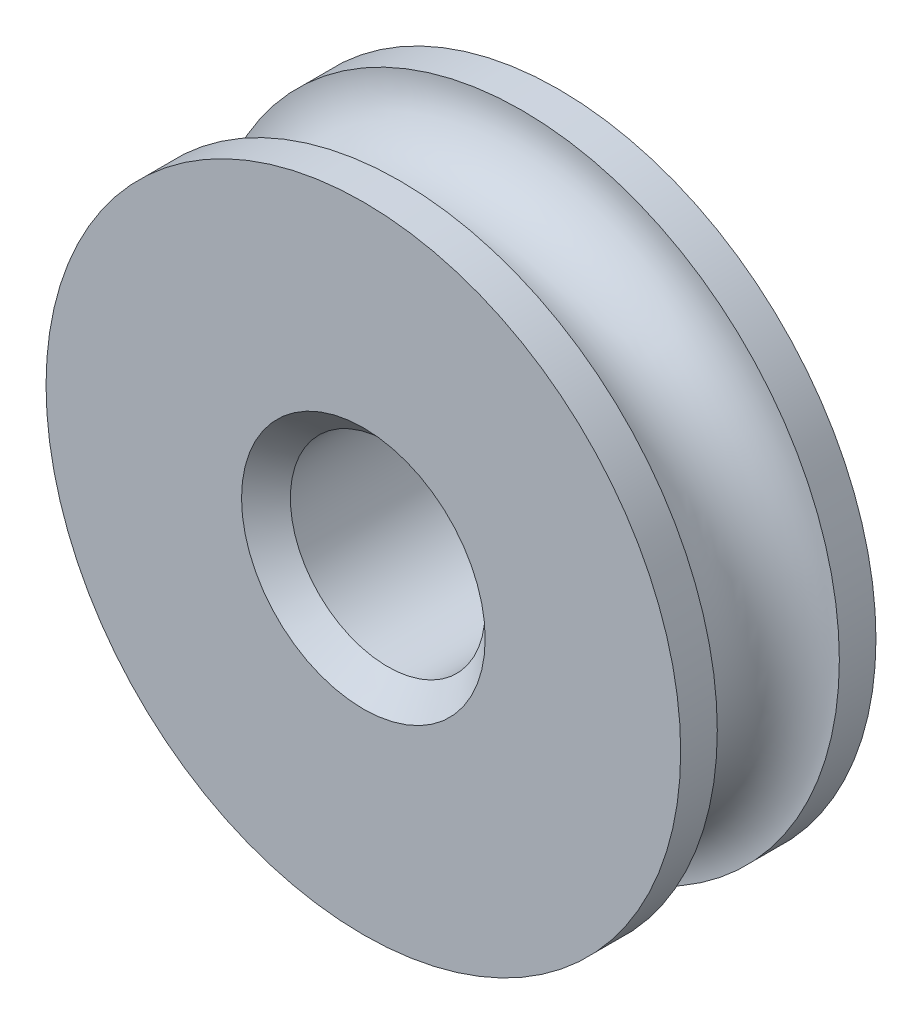
ISO-10303-21;
HEADER;
FILE_DESCRIPTION(('STEP AP214'),'2;1');
FILE_NAME('part.step','',(''),(''),'','','');
FILE_SCHEMA(('AUTOMOTIVE_DESIGN { 1 0 10303 214 1 1 1 1 }'));
ENDSEC;
DATA;
#1=APPLICATION_CONTEXT('core data for automotive mechanical design processes');
#2=APPLICATION_PROTOCOL_DEFINITION('international standard','automotive_design',2000,#1);
#3=PRODUCT_CONTEXT('',#1,'mechanical');
#4=PRODUCT('Part','Part','',(#3));
#5=PRODUCT_RELATED_PRODUCT_CATEGORY('part','',(#4));
#6=PRODUCT_DEFINITION_FORMATION('','',#4);
#7=PRODUCT_DEFINITION_CONTEXT('part definition',#1,'design');
#8=PRODUCT_DEFINITION('design','',#6,#7);
#9=PRODUCT_DEFINITION_SHAPE('','',#8);
#10=(LENGTH_UNIT() NAMED_UNIT(*) SI_UNIT(.MILLI.,.METRE.));
#11=(NAMED_UNIT(*) PLANE_ANGLE_UNIT() SI_UNIT($,.RADIAN.));
#12=(NAMED_UNIT(*) SI_UNIT($,.STERADIAN.) SOLID_ANGLE_UNIT());
#13=UNCERTAINTY_MEASURE_WITH_UNIT(LENGTH_MEASURE(1.E-05),#10,'distance_accuracy_value','');
#14=(GEOMETRIC_REPRESENTATION_CONTEXT(3) GLOBAL_UNCERTAINTY_ASSIGNED_CONTEXT((#13)) GLOBAL_UNIT_ASSIGNED_CONTEXT((#10,
#11,#12)) REPRESENTATION_CONTEXT('',''));
#15=CARTESIAN_POINT('',(0.,0.,0.));
#16=DIRECTION('',(0.,0.,1.));
#17=DIRECTION('',(1.,0.,0.));
#18=AXIS2_PLACEMENT_3D('',#15,#16,#17);
#19=CARTESIAN_POINT('',(1.99563200374817,-190.,0.));
#20=DIRECTION('',(0.,0.,1.));
#21=DIRECTION('',(1.,0.,0.));
#22=AXIS2_PLACEMENT_3D('',#19,#20,#21);
#23=PLANE('',#22);
#24=CARTESIAN_POINT('',(0.,-190.,0.));
#25=DIRECTION('',(0.,0.,1.));
#26=DIRECTION('',(1.,0.,0.));
#27=AXIS2_PLACEMENT_3D('',#24,#25,#26);
#28=CIRCLE('',#27,2.49563200374817);
#29=CARTESIAN_POINT('',(2.49563200374817,-190.,0.));
#30=VERTEX_POINT('',#29);
#31=EDGE_CURVE('E37',#30,#30,#28,.F.);
#32=ORIENTED_EDGE('',*,*,#31,.T.);
#33=EDGE_LOOP('',(#32));
#34=FACE_BOUND('',#33,.T.);
#35=CARTESIAN_POINT('',(0.,-190.,0.));
#36=DIRECTION('',(0.,0.,1.));
#37=DIRECTION('',(1.,0.,0.));
#38=AXIS2_PLACEMENT_3D('',#35,#36,#37);
#39=CIRCLE('',#38,6.50000000000001);
#40=CARTESIAN_POINT('',(6.50000000000001,-190.,0.));
#41=VERTEX_POINT('',#40);
#42=EDGE_CURVE('E50',#41,#41,#39,.T.);
#43=ORIENTED_EDGE('',*,*,#42,.T.);
#44=EDGE_LOOP('',(#43));
#45=FACE_BOUND('',#44,.T.);
#46=ADVANCED_FACE('F30',(#34,#45),#23,.T.);
#47=CARTESIAN_POINT('',(0.,-190.,-5.00000000000009));
#48=DIRECTION('',(0.,0.,1.));
#49=DIRECTION('',(1.,0.,0.));
#50=AXIS2_PLACEMENT_3D('',#47,#48,#49);
#51=CYLINDRICAL_SURFACE('',#50,6.50000000000001);
#52=CARTESIAN_POINT('',(0.,-190.,-0.75));
#53=DIRECTION('',(0.,0.,1.));
#54=DIRECTION('',(1.,0.,0.));
#55=AXIS2_PLACEMENT_3D('',#52,#53,#54);
#56=CIRCLE('',#55,6.50000000000001);
#57=CARTESIAN_POINT('',(6.50000000000001,-190.,-0.75));
#58=VERTEX_POINT('',#57);
#59=EDGE_CURVE('E53',#58,#58,#56,.T.);
#60=ORIENTED_EDGE('',*,*,#59,.T.);
#61=EDGE_LOOP('',(#60));
#62=FACE_BOUND('',#61,.T.);
#63=ORIENTED_EDGE('',*,*,#42,.F.);
#64=EDGE_LOOP('',(#63));
#65=FACE_BOUND('',#64,.T.);
#66=ADVANCED_FACE('F80',(#62,#65),#51,.T.);
#67=CARTESIAN_POINT('',(0.,-190.,-2.));
#68=DIRECTION('',(0.,0.,1.));
#69=DIRECTION('',(1.,0.,0.));
#70=AXIS2_PLACEMENT_3D('',#67,#68,#69);
#71=TOROIDAL_SURFACE('',#70,6.5,1.25);
#72=CARTESIAN_POINT('',(0.,-190.,-3.25));
#73=DIRECTION('',(0.,0.,1.));
#74=DIRECTION('',(1.,0.,0.));
#75=AXIS2_PLACEMENT_3D('',#72,#73,#74);
#76=CIRCLE('',#75,6.5);
#77=CARTESIAN_POINT('',(6.5,-190.,-3.25));
#78=VERTEX_POINT('',#77);
#79=EDGE_CURVE('E56',#78,#78,#76,.T.);
#80=ORIENTED_EDGE('',*,*,#79,.T.);
#81=EDGE_LOOP('',(#80));
#82=FACE_BOUND('',#81,.T.);
#83=ORIENTED_EDGE('',*,*,#59,.F.);
#84=EDGE_LOOP('',(#83));
#85=FACE_BOUND('',#84,.T.);
#86=ADVANCED_FACE('F77',(#82,#85),#71,.F.);
#87=CARTESIAN_POINT('',(0.,-190.,-5.00000000000009));
#88=DIRECTION('',(0.,0.,1.));
#89=DIRECTION('',(1.,0.,0.));
#90=AXIS2_PLACEMENT_3D('',#87,#88,#89);
#91=CYLINDRICAL_SURFACE('',#90,6.5);
#92=CARTESIAN_POINT('',(0.,-190.,-4.));
#93=DIRECTION('',(0.,0.,1.));
#94=DIRECTION('',(1.,0.,0.));
#95=AXIS2_PLACEMENT_3D('',#92,#93,#94);
#96=CIRCLE('',#95,6.5);
#97=CARTESIAN_POINT('',(6.5,-190.,-4.));
#98=VERTEX_POINT('',#97);
#99=EDGE_CURVE('E59',#98,#98,#96,.T.);
#100=ORIENTED_EDGE('',*,*,#99,.T.);
#101=EDGE_LOOP('',(#100));
#102=FACE_BOUND('',#101,.T.);
#103=ORIENTED_EDGE('',*,*,#79,.F.);
#104=EDGE_LOOP('',(#103));
#105=FACE_BOUND('',#104,.T.);
#106=ADVANCED_FACE('F63',(#102,#105),#91,.T.);
#107=CARTESIAN_POINT('',(6.5,-190.,-4.));
#108=DIRECTION('',(0.,0.,-1.));
#109=DIRECTION('',(-1.,0.,0.));
#110=AXIS2_PLACEMENT_3D('',#107,#108,#109);
#111=PLANE('',#110);
#112=CARTESIAN_POINT('',(0.,-190.,-4.));
#113=DIRECTION('',(0.,0.,-1.));
#114=DIRECTION('',(-1.,0.,0.));
#115=AXIS2_PLACEMENT_3D('',#112,#113,#114);
#116=CIRCLE('',#115,2.49563200374817);
#117=CARTESIAN_POINT('',(-2.49563200374817,-190.,-4.));
#118=VERTEX_POINT('',#117);
#119=EDGE_CURVE('E10',#118,#118,#116,.F.);
#120=ORIENTED_EDGE('',*,*,#119,.T.);
#121=EDGE_LOOP('',(#120));
#122=FACE_BOUND('',#121,.T.);
#123=ORIENTED_EDGE('',*,*,#99,.F.);
#124=EDGE_LOOP('',(#123));
#125=FACE_BOUND('',#124,.T.);
#126=ADVANCED_FACE('F66',(#122,#125),#111,.T.);
#127=CARTESIAN_POINT('',(0.,-190.,-5.00000000000009));
#128=DIRECTION('',(0.,0.,1.));
#129=DIRECTION('',(1.,0.,0.));
#130=AXIS2_PLACEMENT_3D('',#127,#128,#129);
#131=CYLINDRICAL_SURFACE('',#130,1.99563200374817);
#132=CARTESIAN_POINT('',(0.,-190.,-0.5));
#133=DIRECTION('',(0.,0.,1.));
#134=DIRECTION('',(1.,0.,0.));
#135=AXIS2_PLACEMENT_3D('',#132,#133,#134);
#136=CIRCLE('',#135,1.99563200374817);
#137=CARTESIAN_POINT('',(1.99563200374817,-190.,-0.5));
#138=VERTEX_POINT('',#137);
#139=EDGE_CURVE('E41',#138,#138,#136,.T.);
#140=ORIENTED_EDGE('',*,*,#139,.T.);
#141=EDGE_LOOP('',(#140));
#142=FACE_BOUND('',#141,.T.);
#143=CARTESIAN_POINT('',(0.,-190.,-3.5));
#144=DIRECTION('',(0.,0.,-1.));
#145=DIRECTION('',(-1.,0.,0.));
#146=AXIS2_PLACEMENT_3D('',#143,#144,#145);
#147=CIRCLE('',#146,1.99563200374817);
#148=CARTESIAN_POINT('',(-1.99563200374817,-190.,-3.5));
#149=VERTEX_POINT('',#148);
#150=EDGE_CURVE('E45',#149,#149,#147,.T.);
#151=ORIENTED_EDGE('',*,*,#150,.T.);
#152=EDGE_LOOP('',(#151));
#153=FACE_BOUND('',#152,.T.);
#154=ADVANCED_FACE('F68',(#142,#153),#131,.F.);
#155=CARTESIAN_POINT('',(0.,-190.,-0.5));
#156=DIRECTION('',(0.,0.,1.));
#157=DIRECTION('',(1.,0.,0.));
#158=AXIS2_PLACEMENT_3D('',#155,#156,#157);
#159=CONICAL_SURFACE('',#158,1.99563200374817,0.785398163397448);
#160=ORIENTED_EDGE('',*,*,#31,.F.);
#161=EDGE_LOOP('',(#160));
#162=FACE_BOUND('',#161,.T.);
#163=ORIENTED_EDGE('',*,*,#139,.F.);
#164=EDGE_LOOP('',(#163));
#165=FACE_BOUND('',#164,.T.);
#166=ADVANCED_FACE('F74',(#162,#165),#159,.F.);
#167=CARTESIAN_POINT('',(0.,-190.,-4.));
#168=DIRECTION('',(0.,0.,-1.));
#169=DIRECTION('',(-1.,0.,0.));
#170=AXIS2_PLACEMENT_3D('',#167,#168,#169);
#171=CONICAL_SURFACE('',#170,2.49563200374817,0.785398163397447);
#172=ORIENTED_EDGE('',*,*,#150,.F.);
#173=EDGE_LOOP('',(#172));
#174=FACE_BOUND('',#173,.T.);
#175=ORIENTED_EDGE('',*,*,#119,.F.);
#176=EDGE_LOOP('',(#175));
#177=FACE_BOUND('',#176,.T.);
#178=ADVANCED_FACE('F32',(#174,#177),#171,.F.);
#179=CLOSED_SHELL('',(#46,#66,#86,#106,#126,#154,#166,#178));
#180=MANIFOLD_SOLID_BREP('B2',#179);
#181=ADVANCED_BREP_SHAPE_REPRESENTATION('',(#18,#180),#14);
#182=SHAPE_DEFINITION_REPRESENTATION(#9,#181);
ENDSEC;
END-ISO-10303-21;
